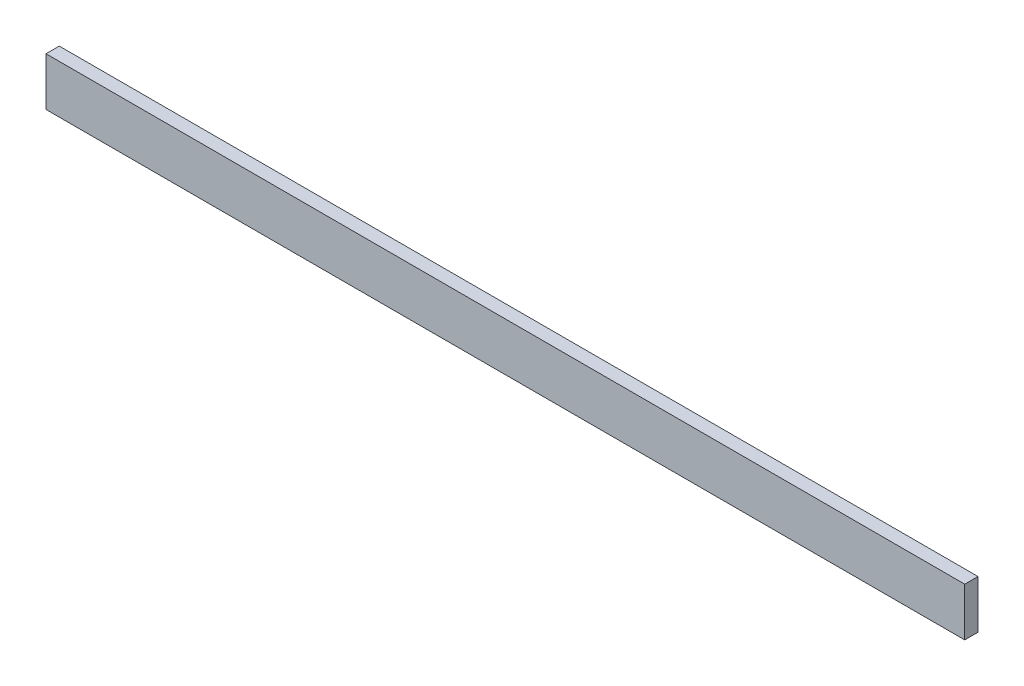
ISO-10303-21;
HEADER;
FILE_DESCRIPTION(('STEP AP214'),'2;1');
FILE_NAME('part.step','',(''),(''),'','','');
FILE_SCHEMA(('AUTOMOTIVE_DESIGN { 1 0 10303 214 1 1 1 1 }'));
ENDSEC;
DATA;
#1=APPLICATION_CONTEXT('core data for automotive mechanical design processes');
#2=APPLICATION_PROTOCOL_DEFINITION('international standard','automotive_design',2000,#1);
#3=PRODUCT_CONTEXT('',#1,'mechanical');
#4=PRODUCT('Part','Part','',(#3));
#5=PRODUCT_RELATED_PRODUCT_CATEGORY('part','',(#4));
#6=PRODUCT_DEFINITION_FORMATION('','',#4);
#7=PRODUCT_DEFINITION_CONTEXT('part definition',#1,'design');
#8=PRODUCT_DEFINITION('design','',#6,#7);
#9=PRODUCT_DEFINITION_SHAPE('','',#8);
#10=(LENGTH_UNIT() NAMED_UNIT(*) SI_UNIT(.MILLI.,.METRE.));
#11=(NAMED_UNIT(*) PLANE_ANGLE_UNIT() SI_UNIT($,.RADIAN.));
#12=(NAMED_UNIT(*) SI_UNIT($,.STERADIAN.) SOLID_ANGLE_UNIT());
#13=UNCERTAINTY_MEASURE_WITH_UNIT(LENGTH_MEASURE(1.E-05),#10,'distance_accuracy_value','');
#14=(GEOMETRIC_REPRESENTATION_CONTEXT(3) GLOBAL_UNCERTAINTY_ASSIGNED_CONTEXT((#13)) GLOBAL_UNIT_ASSIGNED_CONTEXT((#10,
#11,#12)) REPRESENTATION_CONTEXT('',''));
#15=CARTESIAN_POINT('',(0.,0.,0.));
#16=DIRECTION('',(0.,0.,1.));
#17=DIRECTION('',(1.,0.,0.));
#18=AXIS2_PLACEMENT_3D('',#15,#16,#17);
#19=CARTESIAN_POINT('',(0.,0.,22.));
#20=DIRECTION('',(1.,0.,0.));
#21=DIRECTION('',(0.,0.,-1.));
#22=AXIS2_PLACEMENT_3D('',#19,#20,#21);
#23=PLANE('',#22);
#24=DIRECTION('',(0.,-1.,0.));
#25=VECTOR('',#24,1.);
#26=CARTESIAN_POINT('',(0.,0.,0.));
#27=LINE('',#26,#25);
#28=CARTESIAN_POINT('',(0.,80.,0.));
#29=VERTEX_POINT('',#28);
#30=CARTESIAN_POINT('',(0.,0.,0.));
#31=VERTEX_POINT('',#30);
#32=EDGE_CURVE('E95',#29,#31,#27,.T.);
#33=ORIENTED_EDGE('',*,*,#32,.T.);
#34=DIRECTION('',(0.,0.,-1.));
#35=VECTOR('',#34,1.);
#36=CARTESIAN_POINT('',(0.,0.,22.));
#37=LINE('',#36,#35);
#38=CARTESIAN_POINT('',(0.,0.,22.));
#39=VERTEX_POINT('',#38);
#40=EDGE_CURVE('E11',#39,#31,#37,.T.);
#41=ORIENTED_EDGE('',*,*,#40,.F.);
#42=DIRECTION('',(0.,-1.,0.));
#43=VECTOR('',#42,1.);
#44=CARTESIAN_POINT('',(0.,0.,22.));
#45=LINE('',#44,#43);
#46=CARTESIAN_POINT('',(0.,80.,22.));
#47=VERTEX_POINT('',#46);
#48=EDGE_CURVE('E83',#47,#39,#45,.T.);
#49=ORIENTED_EDGE('',*,*,#48,.F.);
#50=DIRECTION('',(0.,0.,-1.));
#51=VECTOR('',#50,1.);
#52=CARTESIAN_POINT('',(0.,80.,22.));
#53=LINE('',#52,#51);
#54=EDGE_CURVE('E91',#47,#29,#53,.T.);
#55=ORIENTED_EDGE('',*,*,#54,.T.);
#56=EDGE_LOOP('',(#33,#41,#49,#55));
#57=FACE_BOUND('',#56,.T.);
#58=ADVANCED_FACE('F32',(#57),#23,.F.);
#59=CARTESIAN_POINT('',(0.,0.,22.));
#60=DIRECTION('',(0.,1.,0.));
#61=DIRECTION('',(0.,0.,1.));
#62=AXIS2_PLACEMENT_3D('',#59,#60,#61);
#63=PLANE('',#62);
#64=DIRECTION('',(1.,0.,0.));
#65=VECTOR('',#64,1.);
#66=CARTESIAN_POINT('',(0.,0.,0.));
#67=LINE('',#66,#65);
#68=CARTESIAN_POINT('',(1522.,0.,0.));
#69=VERTEX_POINT('',#68);
#70=EDGE_CURVE('E87',#31,#69,#67,.T.);
#71=ORIENTED_EDGE('',*,*,#70,.T.);
#72=DIRECTION('',(0.,0.,-1.));
#73=VECTOR('',#72,1.);
#74=CARTESIAN_POINT('',(1522.,0.,22.));
#75=LINE('',#74,#73);
#76=CARTESIAN_POINT('',(1522.,0.,22.));
#77=VERTEX_POINT('',#76);
#78=EDGE_CURVE('E40',#77,#69,#75,.T.);
#79=ORIENTED_EDGE('',*,*,#78,.F.);
#80=DIRECTION('',(1.,0.,0.));
#81=VECTOR('',#80,1.);
#82=CARTESIAN_POINT('',(0.,0.,22.));
#83=LINE('',#82,#81);
#84=EDGE_CURVE('E78',#39,#77,#83,.T.);
#85=ORIENTED_EDGE('',*,*,#84,.F.);
#86=ORIENTED_EDGE('',*,*,#40,.T.);
#87=EDGE_LOOP('',(#71,#79,#85,#86));
#88=FACE_BOUND('',#87,.T.);
#89=ADVANCED_FACE('F86',(#88),#63,.F.);
#90=CARTESIAN_POINT('',(1522.,0.,22.));
#91=DIRECTION('',(-1.,0.,0.));
#92=DIRECTION('',(0.,0.,1.));
#93=AXIS2_PLACEMENT_3D('',#90,#91,#92);
#94=PLANE('',#93);
#95=DIRECTION('',(0.,1.,0.));
#96=VECTOR('',#95,1.);
#97=CARTESIAN_POINT('',(1522.,0.,0.));
#98=LINE('',#97,#96);
#99=CARTESIAN_POINT('',(1522.,80.,0.));
#100=VERTEX_POINT('',#99);
#101=EDGE_CURVE('E65',#69,#100,#98,.T.);
#102=ORIENTED_EDGE('',*,*,#101,.T.);
#103=DIRECTION('',(0.,0.,-1.));
#104=VECTOR('',#103,1.);
#105=CARTESIAN_POINT('',(1522.,80.,22.));
#106=LINE('',#105,#104);
#107=CARTESIAN_POINT('',(1522.,80.,22.));
#108=VERTEX_POINT('',#107);
#109=EDGE_CURVE('E88',#108,#100,#106,.T.);
#110=ORIENTED_EDGE('',*,*,#109,.F.);
#111=DIRECTION('',(0.,1.,0.));
#112=VECTOR('',#111,1.);
#113=CARTESIAN_POINT('',(1522.,0.,22.));
#114=LINE('',#113,#112);
#115=EDGE_CURVE('E81',#77,#108,#114,.T.);
#116=ORIENTED_EDGE('',*,*,#115,.F.);
#117=ORIENTED_EDGE('',*,*,#78,.T.);
#118=EDGE_LOOP('',(#102,#110,#116,#117));
#119=FACE_BOUND('',#118,.T.);
#120=ADVANCED_FACE('F89',(#119),#94,.F.);
#121=CARTESIAN_POINT('',(0.,80.,22.));
#122=DIRECTION('',(0.,-1.,0.));
#123=DIRECTION('',(0.,0.,-1.));
#124=AXIS2_PLACEMENT_3D('',#121,#122,#123);
#125=PLANE('',#124);
#126=DIRECTION('',(-1.,0.,0.));
#127=VECTOR('',#126,1.);
#128=CARTESIAN_POINT('',(0.,80.,0.));
#129=LINE('',#128,#127);
#130=EDGE_CURVE('E71',#100,#29,#129,.T.);
#131=ORIENTED_EDGE('',*,*,#130,.T.);
#132=ORIENTED_EDGE('',*,*,#54,.F.);
#133=DIRECTION('',(-1.,0.,0.));
#134=VECTOR('',#133,1.);
#135=CARTESIAN_POINT('',(0.,80.,22.));
#136=LINE('',#135,#134);
#137=EDGE_CURVE('E48',#108,#47,#136,.T.);
#138=ORIENTED_EDGE('',*,*,#137,.F.);
#139=ORIENTED_EDGE('',*,*,#109,.T.);
#140=EDGE_LOOP('',(#131,#132,#138,#139));
#141=FACE_BOUND('',#140,.T.);
#142=ADVANCED_FACE('F102',(#141),#125,.F.);
#143=CARTESIAN_POINT('',(0.,80.,22.));
#144=DIRECTION('',(0.,0.,-1.));
#145=DIRECTION('',(-1.,0.,0.));
#146=AXIS2_PLACEMENT_3D('',#143,#144,#145);
#147=PLANE('',#146);
#148=ORIENTED_EDGE('',*,*,#48,.T.);
#149=ORIENTED_EDGE('',*,*,#84,.T.);
#150=ORIENTED_EDGE('',*,*,#115,.T.);
#151=ORIENTED_EDGE('',*,*,#137,.T.);
#152=EDGE_LOOP('',(#148,#149,#150,#151));
#153=FACE_BOUND('',#152,.T.);
#154=ADVANCED_FACE('F79',(#153),#147,.F.);
#155=CARTESIAN_POINT('',(0.,80.,0.));
#156=DIRECTION('',(0.,0.,-1.));
#157=DIRECTION('',(-1.,0.,0.));
#158=AXIS2_PLACEMENT_3D('',#155,#156,#157);
#159=PLANE('',#158);
#160=ORIENTED_EDGE('',*,*,#32,.F.);
#161=ORIENTED_EDGE('',*,*,#130,.F.);
#162=ORIENTED_EDGE('',*,*,#101,.F.);
#163=ORIENTED_EDGE('',*,*,#70,.F.);
#164=EDGE_LOOP('',(#160,#161,#162,#163));
#165=FACE_BOUND('',#164,.T.);
#166=ADVANCED_FACE('F105',(#165),#159,.T.);
#167=CLOSED_SHELL('',(#58,#89,#120,#142,#154,#166));
#168=MANIFOLD_SOLID_BREP('B2',#167);
#169=ADVANCED_BREP_SHAPE_REPRESENTATION('',(#18,#168),#14);
#170=SHAPE_DEFINITION_REPRESENTATION(#9,#169);
ENDSEC;
END-ISO-10303-21;
